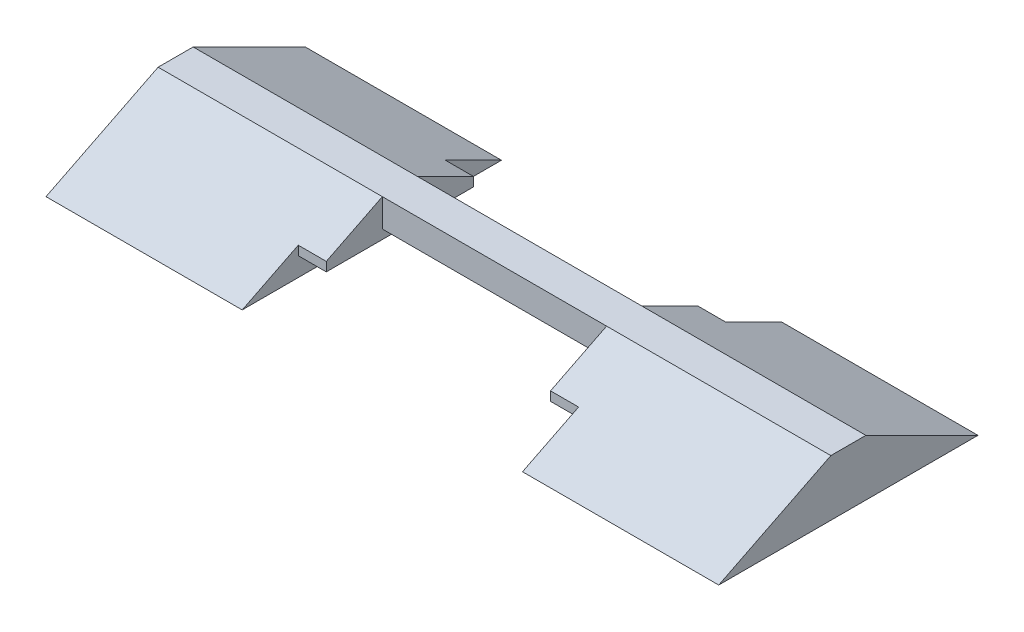
ISO-10303-21;
HEADER;
FILE_DESCRIPTION(('STEP AP214'),'2;1');
FILE_NAME('part.step','',(''),(''),'','','');
FILE_SCHEMA(('AUTOMOTIVE_DESIGN { 1 0 10303 214 1 1 1 1 }'));
ENDSEC;
DATA;
#1=APPLICATION_CONTEXT('core data for automotive mechanical design processes');
#2=APPLICATION_PROTOCOL_DEFINITION('international standard','automotive_design',2000,#1);
#3=PRODUCT_CONTEXT('',#1,'mechanical');
#4=PRODUCT('Part','Part','',(#3));
#5=PRODUCT_RELATED_PRODUCT_CATEGORY('part','',(#4));
#6=PRODUCT_DEFINITION_FORMATION('','',#4);
#7=PRODUCT_DEFINITION_CONTEXT('part definition',#1,'design');
#8=PRODUCT_DEFINITION('design','',#6,#7);
#9=PRODUCT_DEFINITION_SHAPE('','',#8);
#10=(LENGTH_UNIT() NAMED_UNIT(*) SI_UNIT(.MILLI.,.METRE.));
#11=(NAMED_UNIT(*) PLANE_ANGLE_UNIT() SI_UNIT($,.RADIAN.));
#12=(NAMED_UNIT(*) SI_UNIT($,.STERADIAN.) SOLID_ANGLE_UNIT());
#13=UNCERTAINTY_MEASURE_WITH_UNIT(LENGTH_MEASURE(1.E-05),#10,'distance_accuracy_value','');
#14=(GEOMETRIC_REPRESENTATION_CONTEXT(3) GLOBAL_UNCERTAINTY_ASSIGNED_CONTEXT((#13)) GLOBAL_UNIT_ASSIGNED_CONTEXT((#10,
#11,#12)) REPRESENTATION_CONTEXT('',''));
#15=CARTESIAN_POINT('',(0.,0.,0.));
#16=DIRECTION('',(0.,0.,1.));
#17=DIRECTION('',(1.,0.,0.));
#18=AXIS2_PLACEMENT_3D('',#15,#16,#17);
#19=CARTESIAN_POINT('',(0.,0.,1.25));
#20=DIRECTION('',(0.,0.,-1.));
#21=DIRECTION('',(-1.,0.,0.));
#22=AXIS2_PLACEMENT_3D('',#19,#20,#21);
#23=PLANE('',#22);
#24=DIRECTION('',(0.,-1.,0.));
#25=VECTOR('',#24,1.);
#26=CARTESIAN_POINT('',(1.,1.,1.25));
#27=LINE('',#26,#25);
#28=CARTESIAN_POINT('',(1.,1.,1.25));
#29=VERTEX_POINT('',#28);
#30=CARTESIAN_POINT('',(1.,0.,1.25));
#31=VERTEX_POINT('',#30);
#32=EDGE_CURVE('E239',#29,#31,#27,.T.);
#33=ORIENTED_EDGE('',*,*,#32,.T.);
#34=DIRECTION('',(1.,0.,0.));
#35=VECTOR('',#34,1.);
#36=CARTESIAN_POINT('',(1.,0.,1.25));
#37=LINE('',#36,#35);
#38=CARTESIAN_POINT('',(9.,0.,1.25));
#39=VERTEX_POINT('',#38);
#40=EDGE_CURVE('E324',#31,#39,#37,.T.);
#41=ORIENTED_EDGE('',*,*,#40,.T.);
#42=DIRECTION('',(0.,1.,0.));
#43=VECTOR('',#42,1.);
#44=CARTESIAN_POINT('',(9.,-0.325,1.25));
#45=LINE('',#44,#43);
#46=CARTESIAN_POINT('',(9.,1.,1.25));
#47=VERTEX_POINT('',#46);
#48=EDGE_CURVE('E255',#39,#47,#45,.T.);
#49=ORIENTED_EDGE('',*,*,#48,.T.);
#50=DIRECTION('',(-1.,0.,0.));
#51=VECTOR('',#50,1.);
#52=CARTESIAN_POINT('',(10.,1.,1.25));
#53=LINE('',#52,#51);
#54=EDGE_CURVE('E325',#47,#29,#53,.T.);
#55=ORIENTED_EDGE('',*,*,#54,.T.);
#56=EDGE_LOOP('',(#33,#41,#49,#55));
#57=FACE_BOUND('',#56,.T.);
#58=ADVANCED_FACE('F42',(#57),#23,.F.);
#59=CARTESIAN_POINT('',(0.,0.,0.));
#60=DIRECTION('',(0.,0.,-1.));
#61=DIRECTION('',(-1.,0.,0.));
#62=AXIS2_PLACEMENT_3D('',#59,#60,#61);
#63=PLANE('',#62);
#64=DIRECTION('',(1.,0.,0.));
#65=VECTOR('',#64,1.);
#66=CARTESIAN_POINT('',(1.,0.,0.));
#67=LINE('',#66,#65);
#68=CARTESIAN_POINT('',(1.,0.,0.));
#69=VERTEX_POINT('',#68);
#70=CARTESIAN_POINT('',(9.,0.,0.));
#71=VERTEX_POINT('',#70);
#72=EDGE_CURVE('E332',#69,#71,#67,.T.);
#73=ORIENTED_EDGE('',*,*,#72,.F.);
#74=DIRECTION('',(0.,1.,0.));
#75=VECTOR('',#74,1.);
#76=CARTESIAN_POINT('',(1.,0.999999999999999,0.));
#77=LINE('',#76,#75);
#78=CARTESIAN_POINT('',(1.,0.999999999999999,0.));
#79=VERTEX_POINT('',#78);
#80=EDGE_CURVE('E242',#69,#79,#77,.T.);
#81=ORIENTED_EDGE('',*,*,#80,.T.);
#82=DIRECTION('',(-1.,0.,0.));
#83=VECTOR('',#82,1.);
#84=CARTESIAN_POINT('',(0.,1.,0.));
#85=LINE('',#84,#83);
#86=CARTESIAN_POINT('',(9.,1.,0.));
#87=VERTEX_POINT('',#86);
#88=EDGE_CURVE('E333',#87,#79,#85,.T.);
#89=ORIENTED_EDGE('',*,*,#88,.F.);
#90=DIRECTION('',(0.,-1.,0.));
#91=VECTOR('',#90,1.);
#92=CARTESIAN_POINT('',(9.,1.,0.));
#93=LINE('',#92,#91);
#94=EDGE_CURVE('E252',#87,#71,#93,.T.);
#95=ORIENTED_EDGE('',*,*,#94,.T.);
#96=EDGE_LOOP('',(#73,#81,#89,#95));
#97=FACE_BOUND('',#96,.T.);
#98=ADVANCED_FACE('F430',(#97),#63,.T.);
#99=CARTESIAN_POINT('',(0.,1.,1.25));
#100=DIRECTION('',(0.,-1.,0.));
#101=DIRECTION('',(1.,0.,0.));
#102=AXIS2_PLACEMENT_3D('',#99,#100,#101);
#103=PLANE('',#102);
#104=CARTESIAN_POINT('',(17.,1.,0.));
#105=VERTEX_POINT('',#104);
#106=EDGE_CURVE('E195',#105,#87,#85,.T.);
#107=ORIENTED_EDGE('',*,*,#106,.T.);
#108=ORIENTED_EDGE('',*,*,#88,.T.);
#109=CARTESIAN_POINT('',(-7.,0.999999999999999,0.));
#110=VERTEX_POINT('',#109);
#111=EDGE_CURVE('E71',#79,#110,#85,.T.);
#112=ORIENTED_EDGE('',*,*,#111,.T.);
#113=DIRECTION('',(0.,0.,-1.));
#114=VECTOR('',#113,1.);
#115=CARTESIAN_POINT('',(-7.,0.999999999999999,1.25));
#116=LINE('',#115,#114);
#117=CARTESIAN_POINT('',(-7.,0.999999999999999,1.25));
#118=VERTEX_POINT('',#117);
#119=EDGE_CURVE('E11',#118,#110,#116,.T.);
#120=ORIENTED_EDGE('',*,*,#119,.F.);
#121=EDGE_CURVE('E326',#29,#118,#53,.T.);
#122=ORIENTED_EDGE('',*,*,#121,.F.);
#123=ORIENTED_EDGE('',*,*,#54,.F.);
#124=CARTESIAN_POINT('',(17.,1.,1.25));
#125=VERTEX_POINT('',#124);
#126=EDGE_CURVE('E321',#125,#47,#53,.T.);
#127=ORIENTED_EDGE('',*,*,#126,.F.);
#128=DIRECTION('',(0.,0.,-1.));
#129=VECTOR('',#128,1.);
#130=CARTESIAN_POINT('',(17.,1.,1.25));
#131=LINE('',#130,#129);
#132=EDGE_CURVE('E60',#125,#105,#131,.T.);
#133=ORIENTED_EDGE('',*,*,#132,.T.);
#134=EDGE_LOOP('',(#107,#108,#112,#120,#122,#123,#127,#133));
#135=FACE_BOUND('',#134,.T.);
#136=ADVANCED_FACE('F44',(#135),#103,.F.);
#137=CARTESIAN_POINT('',(-7.,0.999999999999999,1.25));
#138=DIRECTION('',(1.,0.,0.));
#139=DIRECTION('',(0.,1.,0.));
#140=AXIS2_PLACEMENT_3D('',#137,#138,#139);
#141=PLANE('',#140);
#142=ORIENTED_EDGE('',*,*,#119,.T.);
#143=DIRECTION('',(0.,-0.447213595499958,-0.894427190999916));
#144=VECTOR('',#143,1.);
#145=CARTESIAN_POINT('',(-7.,0.999999999999999,0.));
#146=LINE('',#145,#144);
#147=CARTESIAN_POINT('',(-7.,-1.,-4.));
#148=VERTEX_POINT('',#147);
#149=EDGE_CURVE('E212',#110,#148,#146,.T.);
#150=ORIENTED_EDGE('',*,*,#149,.T.);
#151=DIRECTION('',(0.,0.,-1.));
#152=VECTOR('',#151,1.);
#153=CARTESIAN_POINT('',(-7.,-1.,1.25));
#154=LINE('',#153,#152);
#155=CARTESIAN_POINT('',(-7.,-1.,5.25));
#156=VERTEX_POINT('',#155);
#157=EDGE_CURVE('E52',#156,#148,#154,.T.);
#158=ORIENTED_EDGE('',*,*,#157,.F.);
#159=DIRECTION('',(0.,0.447213595499958,-0.894427190999916));
#160=VECTOR('',#159,1.);
#161=CARTESIAN_POINT('',(-7.,0.,3.25));
#162=LINE('',#161,#160);
#163=EDGE_CURVE('E224',#156,#118,#162,.T.);
#164=ORIENTED_EDGE('',*,*,#163,.T.);
#165=EDGE_LOOP('',(#142,#150,#158,#164));
#166=FACE_BOUND('',#165,.T.);
#167=ADVANCED_FACE('F371',(#166),#141,.F.);
#168=CARTESIAN_POINT('',(0.,-1.,1.25));
#169=DIRECTION('',(0.,1.,0.));
#170=DIRECTION('',(-1.,0.,0.));
#171=AXIS2_PLACEMENT_3D('',#168,#169,#170);
#172=PLANE('',#171);
#173=ORIENTED_EDGE('',*,*,#157,.T.);
#174=DIRECTION('',(1.,0.,0.));
#175=VECTOR('',#174,1.);
#176=CARTESIAN_POINT('',(-7.,-1.,-4.));
#177=LINE('',#176,#175);
#178=CARTESIAN_POINT('',(0.,-1.,-4.));
#179=VERTEX_POINT('',#178);
#180=EDGE_CURVE('E216',#148,#179,#177,.T.);
#181=ORIENTED_EDGE('',*,*,#180,.T.);
#182=DIRECTION('',(0.,0.,-1.));
#183=VECTOR('',#182,1.);
#184=CARTESIAN_POINT('',(0.,-1.,1.25));
#185=LINE('',#184,#183);
#186=CARTESIAN_POINT('',(0.,-1.,5.25));
#187=VERTEX_POINT('',#186);
#188=EDGE_CURVE('E360',#187,#179,#185,.T.);
#189=ORIENTED_EDGE('',*,*,#188,.F.);
#190=DIRECTION('',(1.,0.,0.));
#191=VECTOR('',#190,1.);
#192=CARTESIAN_POINT('',(-7.,-1.,5.25));
#193=LINE('',#192,#191);
#194=EDGE_CURVE('E228',#156,#187,#193,.T.);
#195=ORIENTED_EDGE('',*,*,#194,.F.);
#196=EDGE_LOOP('',(#173,#181,#189,#195));
#197=FACE_BOUND('',#196,.T.);
#198=ADVANCED_FACE('F366',(#197),#172,.F.);
#199=CARTESIAN_POINT('',(0.,-0.325,1.25));
#200=DIRECTION('',(-1.,0.,0.));
#201=DIRECTION('',(0.,-1.,0.));
#202=AXIS2_PLACEMENT_3D('',#199,#200,#201);
#203=PLANE('',#202);
#204=ORIENTED_EDGE('',*,*,#188,.T.);
#205=DIRECTION('',(0.,-0.447213595499958,-0.894427190999916));
#206=VECTOR('',#205,1.);
#207=CARTESIAN_POINT('',(0.,0.,-2.));
#208=LINE('',#207,#206);
#209=CARTESIAN_POINT('',(0.,0.,-2.));
#210=VERTEX_POINT('',#209);
#211=EDGE_CURVE('E211',#210,#179,#208,.T.);
#212=ORIENTED_EDGE('',*,*,#211,.F.);
#213=DIRECTION('',(0.,1.,0.));
#214=VECTOR('',#213,1.);
#215=CARTESIAN_POINT('',(0.,-0.325,-2.));
#216=LINE('',#215,#214);
#217=CARTESIAN_POINT('',(0.,-0.325,-2.));
#218=VERTEX_POINT('',#217);
#219=EDGE_CURVE('E270',#218,#210,#216,.T.);
#220=ORIENTED_EDGE('',*,*,#219,.F.);
#221=DIRECTION('',(0.,0.,-1.));
#222=VECTOR('',#221,1.);
#223=CARTESIAN_POINT('',(0.,-0.325,1.25));
#224=LINE('',#223,#222);
#225=CARTESIAN_POINT('',(0.,-0.325,3.25));
#226=VERTEX_POINT('',#225);
#227=EDGE_CURVE('E357',#226,#218,#224,.T.);
#228=ORIENTED_EDGE('',*,*,#227,.F.);
#229=DIRECTION('',(0.,-1.,0.));
#230=VECTOR('',#229,1.);
#231=CARTESIAN_POINT('',(0.,-0.325,3.25));
#232=LINE('',#231,#230);
#233=CARTESIAN_POINT('',(0.,0.,3.25));
#234=VERTEX_POINT('',#233);
#235=EDGE_CURVE('E314',#234,#226,#232,.T.);
#236=ORIENTED_EDGE('',*,*,#235,.F.);
#237=DIRECTION('',(0.,0.447213595499958,-0.894427190999916));
#238=VECTOR('',#237,1.);
#239=CARTESIAN_POINT('',(0.,0.999999999999999,1.25));
#240=LINE('',#239,#238);
#241=EDGE_CURVE('E223',#187,#234,#240,.T.);
#242=ORIENTED_EDGE('',*,*,#241,.F.);
#243=EDGE_LOOP('',(#204,#212,#220,#228,#236,#242));
#244=FACE_BOUND('',#243,.T.);
#245=ADVANCED_FACE('F378',(#244),#203,.F.);
#246=CARTESIAN_POINT('',(0.,-0.325,1.25));
#247=DIRECTION('',(0.,1.,0.));
#248=DIRECTION('',(0.,0.,1.));
#249=AXIS2_PLACEMENT_3D('',#246,#247,#248);
#250=PLANE('',#249);
#251=ORIENTED_EDGE('',*,*,#227,.T.);
#252=DIRECTION('',(-1.,0.,0.));
#253=VECTOR('',#252,1.);
#254=CARTESIAN_POINT('',(1.,-0.325,-2.));
#255=LINE('',#254,#253);
#256=CARTESIAN_POINT('',(1.,-0.325,-2.));
#257=VERTEX_POINT('',#256);
#258=EDGE_CURVE('E266',#257,#218,#255,.T.);
#259=ORIENTED_EDGE('',*,*,#258,.F.);
#260=DIRECTION('',(0.,0.,-1.));
#261=VECTOR('',#260,1.);
#262=CARTESIAN_POINT('',(1.,-0.325,1.25));
#263=LINE('',#262,#261);
#264=CARTESIAN_POINT('',(1.,-0.325,3.25));
#265=VERTEX_POINT('',#264);
#266=EDGE_CURVE('E78',#265,#257,#263,.T.);
#267=ORIENTED_EDGE('',*,*,#266,.F.);
#268=DIRECTION('',(1.,0.,0.));
#269=VECTOR('',#268,1.);
#270=CARTESIAN_POINT('',(1.,-0.325,3.25));
#271=LINE('',#270,#269);
#272=EDGE_CURVE('E318',#226,#265,#271,.T.);
#273=ORIENTED_EDGE('',*,*,#272,.F.);
#274=EDGE_LOOP('',(#251,#259,#267,#273));
#275=FACE_BOUND('',#274,.T.);
#276=ADVANCED_FACE('F455',(#275),#250,.F.);
#277=CARTESIAN_POINT('',(1.,0.,1.25));
#278=DIRECTION('',(-1.,0.,0.));
#279=DIRECTION('',(0.,0.,1.));
#280=AXIS2_PLACEMENT_3D('',#277,#278,#279);
#281=PLANE('',#280);
#282=ORIENTED_EDGE('',*,*,#266,.T.);
#283=DIRECTION('',(0.,-1.,0.));
#284=VECTOR('',#283,1.);
#285=CARTESIAN_POINT('',(1.,-0.325,-2.));
#286=LINE('',#285,#284);
#287=CARTESIAN_POINT('',(1.,0.,-2.));
#288=VERTEX_POINT('',#287);
#289=EDGE_CURVE('E262',#288,#257,#286,.T.);
#290=ORIENTED_EDGE('',*,*,#289,.F.);
#291=DIRECTION('',(0.,-0.447213595499958,-0.894427190999916));
#292=VECTOR('',#291,1.);
#293=CARTESIAN_POINT('',(1.,0.,-2.));
#294=LINE('',#293,#292);
#295=EDGE_CURVE('E246',#79,#288,#294,.T.);
#296=ORIENTED_EDGE('',*,*,#295,.F.);
#297=ORIENTED_EDGE('',*,*,#80,.F.);
#298=DIRECTION('',(0.,0.,-1.));
#299=VECTOR('',#298,1.);
#300=CARTESIAN_POINT('',(1.,0.,1.25));
#301=LINE('',#300,#299);
#302=EDGE_CURVE('E351',#31,#69,#301,.T.);
#303=ORIENTED_EDGE('',*,*,#302,.F.);
#304=ORIENTED_EDGE('',*,*,#32,.F.);
#305=DIRECTION('',(0.,0.447213595499958,-0.894427190999916));
#306=VECTOR('',#305,1.);
#307=CARTESIAN_POINT('',(1.,0.,3.25));
#308=LINE('',#307,#306);
#309=CARTESIAN_POINT('',(1.,0.,3.25));
#310=VERTEX_POINT('',#309);
#311=EDGE_CURVE('E235',#310,#29,#308,.T.);
#312=ORIENTED_EDGE('',*,*,#311,.F.);
#313=DIRECTION('',(0.,1.,0.));
#314=VECTOR('',#313,1.);
#315=CARTESIAN_POINT('',(1.,-0.325,3.25));
#316=LINE('',#315,#314);
#317=EDGE_CURVE('E307',#265,#310,#316,.T.);
#318=ORIENTED_EDGE('',*,*,#317,.F.);
#319=EDGE_LOOP('',(#282,#290,#296,#297,#303,#304,#312,#318));
#320=FACE_BOUND('',#319,.T.);
#321=ADVANCED_FACE('F451',(#320),#281,.F.);
#322=CARTESIAN_POINT('',(1.,0.,1.25));
#323=DIRECTION('',(0.,1.,0.));
#324=DIRECTION('',(-1.,0.,0.));
#325=AXIS2_PLACEMENT_3D('',#322,#323,#324);
#326=PLANE('',#325);
#327=ORIENTED_EDGE('',*,*,#72,.T.);
#328=DIRECTION('',(0.,0.,-1.));
#329=VECTOR('',#328,1.);
#330=CARTESIAN_POINT('',(9.,0.,1.25));
#331=LINE('',#330,#329);
#332=EDGE_CURVE('E347',#39,#71,#331,.T.);
#333=ORIENTED_EDGE('',*,*,#332,.F.);
#334=ORIENTED_EDGE('',*,*,#40,.F.);
#335=ORIENTED_EDGE('',*,*,#302,.T.);
#336=EDGE_LOOP('',(#327,#333,#334,#335));
#337=FACE_BOUND('',#336,.T.);
#338=ADVANCED_FACE('F448',(#337),#326,.F.);
#339=CARTESIAN_POINT('',(9.,0.,1.25));
#340=DIRECTION('',(1.,0.,0.));
#341=DIRECTION('',(0.,0.,-1.));
#342=AXIS2_PLACEMENT_3D('',#339,#340,#341);
#343=PLANE('',#342);
#344=DIRECTION('',(0.,1.,0.));
#345=VECTOR('',#344,1.);
#346=CARTESIAN_POINT('',(9.,-0.325,-2.));
#347=LINE('',#346,#345);
#348=CARTESIAN_POINT('',(9.,-0.325,-2.));
#349=VERTEX_POINT('',#348);
#350=CARTESIAN_POINT('',(9.,0.,-2.));
#351=VERTEX_POINT('',#350);
#352=EDGE_CURVE('E277',#349,#351,#347,.T.);
#353=ORIENTED_EDGE('',*,*,#352,.F.);
#354=DIRECTION('',(0.,0.,-1.));
#355=VECTOR('',#354,1.);
#356=CARTESIAN_POINT('',(9.,-0.325,1.25));
#357=LINE('',#356,#355);
#358=CARTESIAN_POINT('',(9.,-0.325,3.25));
#359=VERTEX_POINT('',#358);
#360=EDGE_CURVE('E344',#359,#349,#357,.T.);
#361=ORIENTED_EDGE('',*,*,#360,.F.);
#362=DIRECTION('',(0.,-1.,0.));
#363=VECTOR('',#362,1.);
#364=CARTESIAN_POINT('',(9.,-0.325,3.25));
#365=LINE('',#364,#363);
#366=CARTESIAN_POINT('',(9.,0.,3.25));
#367=VERTEX_POINT('',#366);
#368=EDGE_CURVE('E292',#367,#359,#365,.T.);
#369=ORIENTED_EDGE('',*,*,#368,.F.);
#370=DIRECTION('',(0.,-0.447213595499958,0.894427190999916));
#371=VECTOR('',#370,1.);
#372=CARTESIAN_POINT('',(9.,0.,3.25));
#373=LINE('',#372,#371);
#374=EDGE_CURVE('E259',#47,#367,#373,.T.);
#375=ORIENTED_EDGE('',*,*,#374,.F.);
#376=ORIENTED_EDGE('',*,*,#48,.F.);
#377=ORIENTED_EDGE('',*,*,#332,.T.);
#378=ORIENTED_EDGE('',*,*,#94,.F.);
#379=DIRECTION('',(0.,0.447213595499958,0.894427190999916));
#380=VECTOR('',#379,1.);
#381=CARTESIAN_POINT('',(9.,0.,-2.));
#382=LINE('',#381,#380);
#383=EDGE_CURVE('E249',#351,#87,#382,.T.);
#384=ORIENTED_EDGE('',*,*,#383,.F.);
#385=EDGE_LOOP('',(#353,#361,#369,#375,#376,#377,#378,#384));
#386=FACE_BOUND('',#385,.T.);
#387=ADVANCED_FACE('F408',(#386),#343,.F.);
#388=CARTESIAN_POINT('',(10.,-0.325,1.25));
#389=DIRECTION('',(0.,1.,0.));
#390=DIRECTION('',(-1.,0.,0.));
#391=AXIS2_PLACEMENT_3D('',#388,#389,#390);
#392=PLANE('',#391);
#393=DIRECTION('',(0.,0.,-1.));
#394=VECTOR('',#393,1.);
#395=CARTESIAN_POINT('',(10.,-0.325,1.25));
#396=LINE('',#395,#394);
#397=CARTESIAN_POINT('',(10.,-0.325,3.25));
#398=VERTEX_POINT('',#397);
#399=CARTESIAN_POINT('',(10.,-0.325,-2.));
#400=VERTEX_POINT('',#399);
#401=EDGE_CURVE('E341',#398,#400,#396,.T.);
#402=ORIENTED_EDGE('',*,*,#401,.F.);
#403=DIRECTION('',(1.,0.,0.));
#404=VECTOR('',#403,1.);
#405=CARTESIAN_POINT('',(9.,-0.325,3.25));
#406=LINE('',#405,#404);
#407=EDGE_CURVE('E296',#359,#398,#406,.T.);
#408=ORIENTED_EDGE('',*,*,#407,.F.);
#409=ORIENTED_EDGE('',*,*,#360,.T.);
#410=DIRECTION('',(-1.,0.,0.));
#411=VECTOR('',#410,1.);
#412=CARTESIAN_POINT('',(9.,-0.325,-2.));
#413=LINE('',#412,#411);
#414=EDGE_CURVE('E288',#400,#349,#413,.T.);
#415=ORIENTED_EDGE('',*,*,#414,.F.);
#416=EDGE_LOOP('',(#402,#408,#409,#415));
#417=FACE_BOUND('',#416,.T.);
#418=ADVANCED_FACE('F413',(#417),#392,.F.);
#419=CARTESIAN_POINT('',(10.,-0.325,1.25));
#420=DIRECTION('',(1.,0.,0.));
#421=DIRECTION('',(0.,0.,-1.));
#422=AXIS2_PLACEMENT_3D('',#419,#420,#421);
#423=PLANE('',#422);
#424=ORIENTED_EDGE('',*,*,#401,.T.);
#425=DIRECTION('',(0.,-1.,0.));
#426=VECTOR('',#425,1.);
#427=CARTESIAN_POINT('',(10.,-0.325,-2.));
#428=LINE('',#427,#426);
#429=CARTESIAN_POINT('',(10.,0.,-2.));
#430=VERTEX_POINT('',#429);
#431=EDGE_CURVE('E284',#430,#400,#428,.T.);
#432=ORIENTED_EDGE('',*,*,#431,.F.);
#433=DIRECTION('',(0.,0.447213595499958,0.894427190999916));
#434=VECTOR('',#433,1.);
#435=CARTESIAN_POINT('',(10.,1.,0.));
#436=LINE('',#435,#434);
#437=CARTESIAN_POINT('',(10.,-1.,-4.));
#438=VERTEX_POINT('',#437);
#439=EDGE_CURVE('E197',#438,#430,#436,.T.);
#440=ORIENTED_EDGE('',*,*,#439,.F.);
#441=DIRECTION('',(0.,0.,-1.));
#442=VECTOR('',#441,1.);
#443=CARTESIAN_POINT('',(10.,-1.,1.25));
#444=LINE('',#443,#442);
#445=CARTESIAN_POINT('',(10.,-1.,5.25));
#446=VERTEX_POINT('',#445);
#447=EDGE_CURVE('E182',#446,#438,#444,.T.);
#448=ORIENTED_EDGE('',*,*,#447,.F.);
#449=DIRECTION('',(0.,-0.447213595499958,0.894427190999916));
#450=VECTOR('',#449,1.);
#451=CARTESIAN_POINT('',(10.,1.,1.25));
#452=LINE('',#451,#450);
#453=CARTESIAN_POINT('',(10.,0.,3.25));
#454=VERTEX_POINT('',#453);
#455=EDGE_CURVE('E191',#454,#446,#452,.T.);
#456=ORIENTED_EDGE('',*,*,#455,.F.);
#457=DIRECTION('',(0.,1.,0.));
#458=VECTOR('',#457,1.);
#459=CARTESIAN_POINT('',(10.,-0.325,3.25));
#460=LINE('',#459,#458);
#461=EDGE_CURVE('E300',#398,#454,#460,.T.);
#462=ORIENTED_EDGE('',*,*,#461,.F.);
#463=EDGE_LOOP('',(#424,#432,#440,#448,#456,#462));
#464=FACE_BOUND('',#463,.T.);
#465=ADVANCED_FACE('F401',(#464),#423,.F.);
#466=CARTESIAN_POINT('',(10.,-1.,1.25));
#467=DIRECTION('',(0.,1.,0.));
#468=DIRECTION('',(0.,0.,1.));
#469=AXIS2_PLACEMENT_3D('',#466,#467,#468);
#470=PLANE('',#469);
#471=ORIENTED_EDGE('',*,*,#447,.T.);
#472=DIRECTION('',(-1.,0.,0.));
#473=VECTOR('',#472,1.);
#474=CARTESIAN_POINT('',(17.,-1.,-4.));
#475=LINE('',#474,#473);
#476=CARTESIAN_POINT('',(17.,-1.,-4.));
#477=VERTEX_POINT('',#476);
#478=EDGE_CURVE('E185',#477,#438,#475,.T.);
#479=ORIENTED_EDGE('',*,*,#478,.F.);
#480=DIRECTION('',(0.,0.,-1.));
#481=VECTOR('',#480,1.);
#482=CARTESIAN_POINT('',(17.,-1.,1.25));
#483=LINE('',#482,#481);
#484=CARTESIAN_POINT('',(17.,-1.,5.25));
#485=VERTEX_POINT('',#484);
#486=EDGE_CURVE('E170',#485,#477,#483,.T.);
#487=ORIENTED_EDGE('',*,*,#486,.F.);
#488=DIRECTION('',(-1.,0.,0.));
#489=VECTOR('',#488,1.);
#490=CARTESIAN_POINT('',(17.,-1.,5.25));
#491=LINE('',#490,#489);
#492=EDGE_CURVE('E205',#485,#446,#491,.T.);
#493=ORIENTED_EDGE('',*,*,#492,.T.);
#494=EDGE_LOOP('',(#471,#479,#487,#493));
#495=FACE_BOUND('',#494,.T.);
#496=ADVANCED_FACE('F186',(#495),#470,.F.);
#497=CARTESIAN_POINT('',(17.,1.,1.25));
#498=DIRECTION('',(-1.,0.,0.));
#499=DIRECTION('',(0.,0.,1.));
#500=AXIS2_PLACEMENT_3D('',#497,#498,#499);
#501=PLANE('',#500);
#502=ORIENTED_EDGE('',*,*,#486,.T.);
#503=DIRECTION('',(0.,0.447213595499958,0.894427190999916));
#504=VECTOR('',#503,1.);
#505=CARTESIAN_POINT('',(17.,1.,0.));
#506=LINE('',#505,#504);
#507=EDGE_CURVE('E174',#477,#105,#506,.T.);
#508=ORIENTED_EDGE('',*,*,#507,.T.);
#509=ORIENTED_EDGE('',*,*,#132,.F.);
#510=DIRECTION('',(0.,-0.447213595499958,0.894427190999916));
#511=VECTOR('',#510,1.);
#512=CARTESIAN_POINT('',(17.,1.,1.25));
#513=LINE('',#512,#511);
#514=EDGE_CURVE('E177',#125,#485,#513,.T.);
#515=ORIENTED_EDGE('',*,*,#514,.T.);
#516=EDGE_LOOP('',(#502,#508,#509,#515));
#517=FACE_BOUND('',#516,.T.);
#518=ADVANCED_FACE('F172',(#517),#501,.F.);
#519=CARTESIAN_POINT('',(0.,0.,3.25));
#520=DIRECTION('',(0.,0.,1.));
#521=DIRECTION('',(1.,0.,0.));
#522=AXIS2_PLACEMENT_3D('',#519,#520,#521);
#523=PLANE('',#522);
#524=ORIENTED_EDGE('',*,*,#317,.T.);
#525=DIRECTION('',(-1.,0.,0.));
#526=VECTOR('',#525,1.);
#527=CARTESIAN_POINT('',(1.,0.,3.25));
#528=LINE('',#527,#526);
#529=EDGE_CURVE('E311',#310,#234,#528,.T.);
#530=ORIENTED_EDGE('',*,*,#529,.T.);
#531=ORIENTED_EDGE('',*,*,#235,.T.);
#532=ORIENTED_EDGE('',*,*,#272,.T.);
#533=EDGE_LOOP('',(#524,#530,#531,#532));
#534=FACE_BOUND('',#533,.T.);
#535=ADVANCED_FACE('F419',(#534),#523,.T.);
#536=CARTESIAN_POINT('',(0.,0.,3.25));
#537=DIRECTION('',(0.,0.,-1.));
#538=DIRECTION('',(-1.,0.,0.));
#539=AXIS2_PLACEMENT_3D('',#536,#537,#538);
#540=PLANE('',#539);
#541=ORIENTED_EDGE('',*,*,#368,.T.);
#542=ORIENTED_EDGE('',*,*,#407,.T.);
#543=ORIENTED_EDGE('',*,*,#461,.T.);
#544=DIRECTION('',(-1.,0.,0.));
#545=VECTOR('',#544,1.);
#546=CARTESIAN_POINT('',(9.,0.,3.25));
#547=LINE('',#546,#545);
#548=EDGE_CURVE('E303',#454,#367,#547,.T.);
#549=ORIENTED_EDGE('',*,*,#548,.T.);
#550=EDGE_LOOP('',(#541,#542,#543,#549));
#551=FACE_BOUND('',#550,.T.);
#552=ADVANCED_FACE('F417',(#551),#540,.F.);
#553=CARTESIAN_POINT('',(0.,0.,-2.));
#554=DIRECTION('',(0.,0.,-1.));
#555=DIRECTION('',(-1.,0.,0.));
#556=AXIS2_PLACEMENT_3D('',#553,#554,#555);
#557=PLANE('',#556);
#558=ORIENTED_EDGE('',*,*,#352,.T.);
#559=DIRECTION('',(1.,0.,0.));
#560=VECTOR('',#559,1.);
#561=CARTESIAN_POINT('',(9.,0.,-2.));
#562=LINE('',#561,#560);
#563=EDGE_CURVE('E281',#351,#430,#562,.T.);
#564=ORIENTED_EDGE('',*,*,#563,.T.);
#565=ORIENTED_EDGE('',*,*,#431,.T.);
#566=ORIENTED_EDGE('',*,*,#414,.T.);
#567=EDGE_LOOP('',(#558,#564,#565,#566));
#568=FACE_BOUND('',#567,.T.);
#569=ADVANCED_FACE('F410',(#568),#557,.T.);
#570=CARTESIAN_POINT('',(0.,0.,-2.));
#571=DIRECTION('',(0.,0.,1.));
#572=DIRECTION('',(1.,0.,0.));
#573=AXIS2_PLACEMENT_3D('',#570,#571,#572);
#574=PLANE('',#573);
#575=ORIENTED_EDGE('',*,*,#289,.T.);
#576=ORIENTED_EDGE('',*,*,#258,.T.);
#577=ORIENTED_EDGE('',*,*,#219,.T.);
#578=DIRECTION('',(1.,0.,0.));
#579=VECTOR('',#578,1.);
#580=CARTESIAN_POINT('',(1.,0.,-2.));
#581=LINE('',#580,#579);
#582=EDGE_CURVE('E273',#210,#288,#581,.T.);
#583=ORIENTED_EDGE('',*,*,#582,.T.);
#584=EDGE_LOOP('',(#575,#576,#577,#583));
#585=FACE_BOUND('',#584,.T.);
#586=ADVANCED_FACE('F425',(#585),#574,.F.);
#587=CARTESIAN_POINT('',(9.,0.,3.25));
#588=DIRECTION('',(0.,0.894427190999916,0.447213595499958));
#589=DIRECTION('',(0.,-0.447213595499958,0.894427190999916));
#590=AXIS2_PLACEMENT_3D('',#587,#588,#589);
#591=PLANE('',#590);
#592=ORIENTED_EDGE('',*,*,#548,.F.);
#593=ORIENTED_EDGE('',*,*,#455,.T.);
#594=ORIENTED_EDGE('',*,*,#492,.F.);
#595=ORIENTED_EDGE('',*,*,#514,.F.);
#596=ORIENTED_EDGE('',*,*,#126,.T.);
#597=ORIENTED_EDGE('',*,*,#374,.T.);
#598=EDGE_LOOP('',(#592,#593,#594,#595,#596,#597));
#599=FACE_BOUND('',#598,.T.);
#600=ADVANCED_FACE('F397',(#599),#591,.T.);
#601=CARTESIAN_POINT('',(9.,0.,-2.));
#602=DIRECTION('',(0.,0.894427190999916,-0.447213595499958));
#603=DIRECTION('',(0.,0.447213595499958,0.894427190999916));
#604=AXIS2_PLACEMENT_3D('',#601,#602,#603);
#605=PLANE('',#604);
#606=ORIENTED_EDGE('',*,*,#383,.T.);
#607=ORIENTED_EDGE('',*,*,#106,.F.);
#608=ORIENTED_EDGE('',*,*,#507,.F.);
#609=ORIENTED_EDGE('',*,*,#478,.T.);
#610=ORIENTED_EDGE('',*,*,#439,.T.);
#611=ORIENTED_EDGE('',*,*,#563,.F.);
#612=EDGE_LOOP('',(#606,#607,#608,#609,#610,#611));
#613=FACE_BOUND('',#612,.T.);
#614=ADVANCED_FACE('F194',(#613),#605,.T.);
#615=CARTESIAN_POINT('',(1.,0.,-2.));
#616=DIRECTION('',(0.,0.894427190999916,-0.447213595499958));
#617=DIRECTION('',(0.,0.447213595499958,0.894427190999916));
#618=AXIS2_PLACEMENT_3D('',#615,#616,#617);
#619=PLANE('',#618);
#620=ORIENTED_EDGE('',*,*,#582,.F.);
#621=ORIENTED_EDGE('',*,*,#211,.T.);
#622=ORIENTED_EDGE('',*,*,#180,.F.);
#623=ORIENTED_EDGE('',*,*,#149,.F.);
#624=ORIENTED_EDGE('',*,*,#111,.F.);
#625=ORIENTED_EDGE('',*,*,#295,.T.);
#626=EDGE_LOOP('',(#620,#621,#622,#623,#624,#625));
#627=FACE_BOUND('',#626,.T.);
#628=ADVANCED_FACE('F374',(#627),#619,.T.);
#629=CARTESIAN_POINT('',(1.,0.,3.25));
#630=DIRECTION('',(0.,0.894427190999916,0.447213595499958));
#631=DIRECTION('',(0.,-0.447213595499958,0.894427190999916));
#632=AXIS2_PLACEMENT_3D('',#629,#630,#631);
#633=PLANE('',#632);
#634=ORIENTED_EDGE('',*,*,#311,.T.);
#635=ORIENTED_EDGE('',*,*,#121,.T.);
#636=ORIENTED_EDGE('',*,*,#163,.F.);
#637=ORIENTED_EDGE('',*,*,#194,.T.);
#638=ORIENTED_EDGE('',*,*,#241,.T.);
#639=ORIENTED_EDGE('',*,*,#529,.F.);
#640=EDGE_LOOP('',(#634,#635,#636,#637,#638,#639));
#641=FACE_BOUND('',#640,.T.);
#642=ADVANCED_FACE('F382',(#641),#633,.T.);
#643=CLOSED_SHELL('',(#58,#98,#136,#167,#198,#245,#276,#321,#338,#387,#418,#465,#496,#518,#535,
#552,#569,#586,#600,#614,#628,#642));
#644=MANIFOLD_SOLID_BREP('B2',#643);
#645=ADVANCED_BREP_SHAPE_REPRESENTATION('',(#18,#644),#14);
#646=SHAPE_DEFINITION_REPRESENTATION(#9,#645);
ENDSEC;
END-ISO-10303-21;
